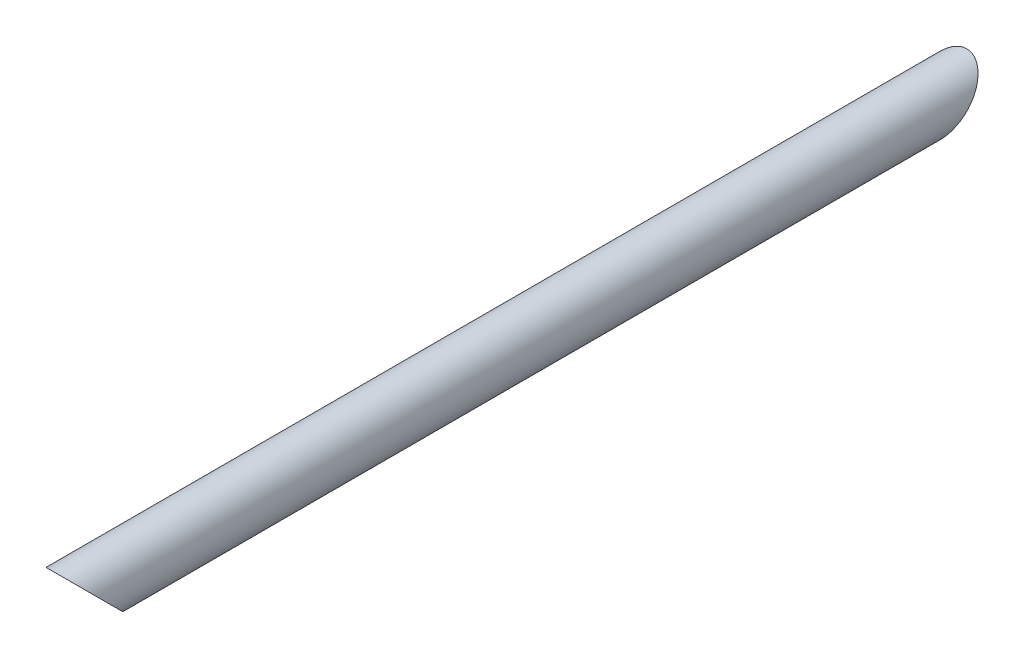
ISO-10303-21;
HEADER;
FILE_DESCRIPTION(('STEP AP214'),'2;1');
FILE_NAME('part.step','',(''),(''),'','','');
FILE_SCHEMA(('AUTOMOTIVE_DESIGN { 1 0 10303 214 1 1 1 1 }'));
ENDSEC;
DATA;
#1=APPLICATION_CONTEXT('core data for automotive mechanical design processes');
#2=APPLICATION_PROTOCOL_DEFINITION('international standard','automotive_design',2000,#1);
#3=PRODUCT_CONTEXT('',#1,'mechanical');
#4=PRODUCT('Part','Part','',(#3));
#5=PRODUCT_RELATED_PRODUCT_CATEGORY('part','',(#4));
#6=PRODUCT_DEFINITION_FORMATION('','',#4);
#7=PRODUCT_DEFINITION_CONTEXT('part definition',#1,'design');
#8=PRODUCT_DEFINITION('design','',#6,#7);
#9=PRODUCT_DEFINITION_SHAPE('','',#8);
#10=(LENGTH_UNIT() NAMED_UNIT(*) SI_UNIT(.MILLI.,.METRE.));
#11=(NAMED_UNIT(*) PLANE_ANGLE_UNIT() SI_UNIT($,.RADIAN.));
#12=(NAMED_UNIT(*) SI_UNIT($,.STERADIAN.) SOLID_ANGLE_UNIT());
#13=UNCERTAINTY_MEASURE_WITH_UNIT(LENGTH_MEASURE(1.E-05),#10,'distance_accuracy_value','');
#14=(GEOMETRIC_REPRESENTATION_CONTEXT(3) GLOBAL_UNCERTAINTY_ASSIGNED_CONTEXT((#13)) GLOBAL_UNIT_ASSIGNED_CONTEXT((#10,
#11,#12)) REPRESENTATION_CONTEXT('',''));
#15=CARTESIAN_POINT('',(0.,0.,0.));
#16=DIRECTION('',(0.,0.,1.));
#17=DIRECTION('',(1.,0.,0.));
#18=AXIS2_PLACEMENT_3D('',#15,#16,#17);
#19=CARTESIAN_POINT('',(0.,350.,199.999999999996));
#20=DIRECTION('',(0.,0.,-1.));
#21=DIRECTION('',(-1.,0.,0.));
#22=AXIS2_PLACEMENT_3D('',#19,#20,#21);
#23=CYLINDRICAL_SURFACE('',#22,9.65);
#24=CARTESIAN_POINT('',(-1.68322387278375E-13,350.,-200.000000000003));
#25=DIRECTION('',(0.,-0.707106781186548,-0.707106781186548));
#26=DIRECTION('',(0.,0.707106781186548,-0.707106781186548));
#27=AXIS2_PLACEMENT_3D('',#24,#25,#26);
#28=ELLIPSE('',#27,13.6471608769004,9.65);
#29=CARTESIAN_POINT('',(-1.72278539361821E-13,359.65,-209.650000000003));
#30=VERTEX_POINT('',#29);
#31=EDGE_CURVE('E55',#30,#30,#28,.T.);
#32=ORIENTED_EDGE('',*,*,#31,.T.);
#33=EDGE_LOOP('',(#32));
#34=FACE_BOUND('',#33,.T.);
#35=CARTESIAN_POINT('',(0.,350.,199.999999999996));
#36=DIRECTION('',(0.,-0.707106781186544,0.707106781186551));
#37=DIRECTION('',(0.,-0.707106781186551,-0.707106781186544));
#38=AXIS2_PLACEMENT_3D('',#35,#36,#37);
#39=ELLIPSE('',#38,13.6471608769003,9.65);
#40=CARTESIAN_POINT('',(0.,340.35,190.349999999997));
#41=VERTEX_POINT('',#40);
#42=EDGE_CURVE('E42',#41,#41,#39,.T.);
#43=ORIENTED_EDGE('',*,*,#42,.T.);
#44=EDGE_LOOP('',(#43));
#45=FACE_BOUND('',#44,.T.);
#46=ADVANCED_FACE('F38',(#34,#45),#23,.F.);
#47=CARTESIAN_POINT('',(0.,350.,199.999999999996));
#48=DIRECTION('',(0.,0.,-1.));
#49=DIRECTION('',(-1.,0.,0.));
#50=AXIS2_PLACEMENT_3D('',#47,#48,#49);
#51=CYLINDRICAL_SURFACE('',#50,12.7);
#52=CARTESIAN_POINT('',(-1.68322387278375E-13,350.,-200.000000000003));
#53=DIRECTION('',(0.,-0.707106781186548,-0.707106781186548));
#54=DIRECTION('',(0.,0.707106781186548,-0.707106781186548));
#55=AXIS2_PLACEMENT_3D('',#52,#53,#54);
#56=ELLIPSE('',#55,17.9605122421383,12.7);
#57=CARTESIAN_POINT('',(-1.73528929398557E-13,362.7,-212.700000000003));
#58=VERTEX_POINT('',#57);
#59=EDGE_CURVE('E47',#58,#58,#56,.T.);
#60=ORIENTED_EDGE('',*,*,#59,.F.);
#61=EDGE_LOOP('',(#60));
#62=FACE_BOUND('',#61,.T.);
#63=CARTESIAN_POINT('',(0.,350.,199.999999999996));
#64=DIRECTION('',(0.,-0.707106781186544,0.707106781186551));
#65=DIRECTION('',(0.,-0.707106781186551,-0.707106781186544));
#66=AXIS2_PLACEMENT_3D('',#63,#64,#65);
#67=ELLIPSE('',#66,17.9605122421382,12.7);
#68=CARTESIAN_POINT('',(0.,337.3,187.299999999997));
#69=VERTEX_POINT('',#68);
#70=EDGE_CURVE('E10',#69,#69,#67,.T.);
#71=ORIENTED_EDGE('',*,*,#70,.F.);
#72=EDGE_LOOP('',(#71));
#73=FACE_BOUND('',#72,.T.);
#74=ADVANCED_FACE('F73',(#62,#73),#51,.T.);
#75=CARTESIAN_POINT('',(-1.67164090169531E-13,350.,-200.000000000003));
#76=DIRECTION('',(0.,-0.707106781186548,-0.707106781186548));
#77=DIRECTION('',(0.,0.707106781186548,-0.707106781186548));
#78=AXIS2_PLACEMENT_3D('',#75,#76,#77);
#79=PLANE('',#78);
#80=ORIENTED_EDGE('',*,*,#31,.F.);
#81=EDGE_LOOP('',(#80));
#82=FACE_BOUND('',#81,.T.);
#83=ORIENTED_EDGE('',*,*,#59,.T.);
#84=EDGE_LOOP('',(#83));
#85=FACE_BOUND('',#84,.T.);
#86=ADVANCED_FACE('F68',(#82,#85),#79,.T.);
#87=CARTESIAN_POINT('',(0.,350.,199.999999999996));
#88=DIRECTION('',(0.,-0.707106781186544,0.707106781186551));
#89=DIRECTION('',(0.,-0.707106781186551,-0.707106781186544));
#90=AXIS2_PLACEMENT_3D('',#87,#88,#89);
#91=PLANE('',#90);
#92=ORIENTED_EDGE('',*,*,#42,.F.);
#93=EDGE_LOOP('',(#92));
#94=FACE_BOUND('',#93,.T.);
#95=ORIENTED_EDGE('',*,*,#70,.T.);
#96=EDGE_LOOP('',(#95));
#97=FACE_BOUND('',#96,.T.);
#98=ADVANCED_FACE('F40',(#94,#97),#91,.T.);
#99=CLOSED_SHELL('',(#46,#74,#86,#98));
#100=MANIFOLD_SOLID_BREP('B2',#99);
#101=ADVANCED_BREP_SHAPE_REPRESENTATION('',(#18,#100),#14);
#102=SHAPE_DEFINITION_REPRESENTATION(#9,#101);
ENDSEC;
END-ISO-10303-21;
